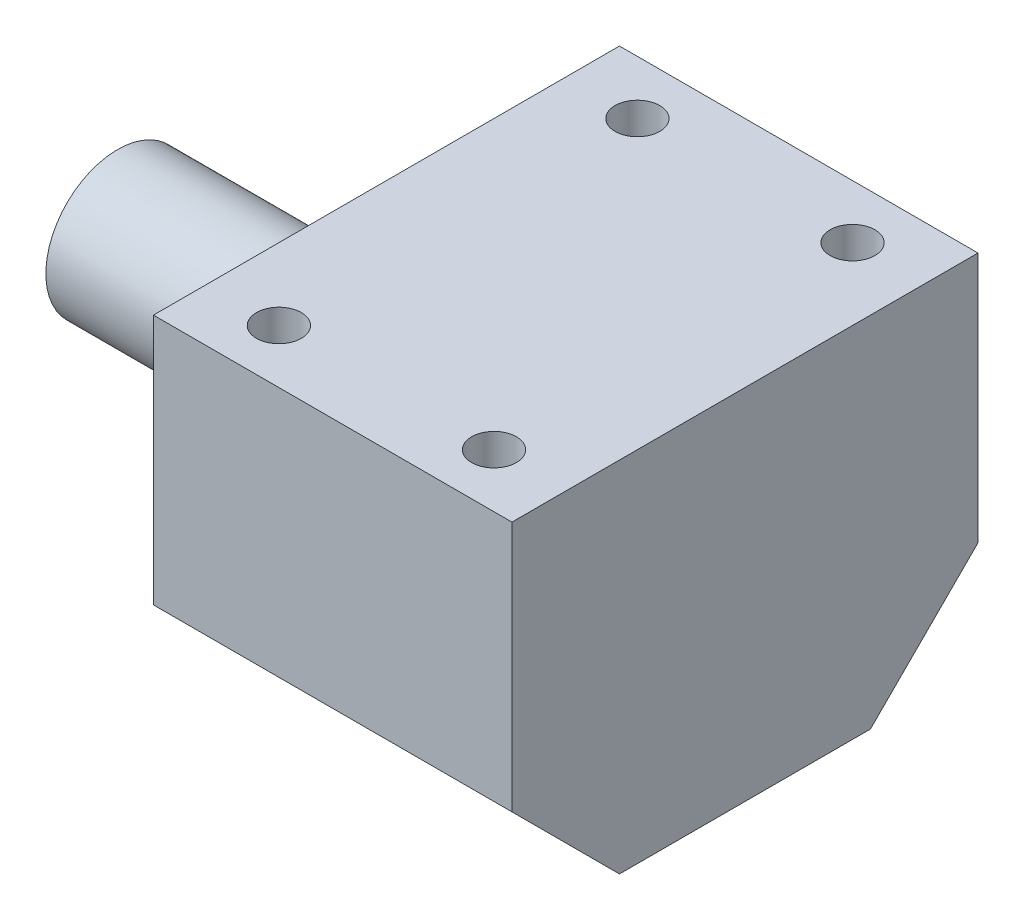
ISO-10303-21;
HEADER;
FILE_DESCRIPTION(('STEP AP214'),'2;1');
FILE_NAME('part.step','',(''),(''),'','','');
FILE_SCHEMA(('AUTOMOTIVE_DESIGN { 1 0 10303 214 1 1 1 1 }'));
ENDSEC;
DATA;
#1=APPLICATION_CONTEXT('core data for automotive mechanical design processes');
#2=APPLICATION_PROTOCOL_DEFINITION('international standard','automotive_design',2000,#1);
#3=PRODUCT_CONTEXT('',#1,'mechanical');
#4=PRODUCT('Part','Part','',(#3));
#5=PRODUCT_RELATED_PRODUCT_CATEGORY('part','',(#4));
#6=PRODUCT_DEFINITION_FORMATION('','',#4);
#7=PRODUCT_DEFINITION_CONTEXT('part definition',#1,'design');
#8=PRODUCT_DEFINITION('design','',#6,#7);
#9=PRODUCT_DEFINITION_SHAPE('','',#8);
#10=(LENGTH_UNIT() NAMED_UNIT(*) SI_UNIT(.MILLI.,.METRE.));
#11=(NAMED_UNIT(*) PLANE_ANGLE_UNIT() SI_UNIT($,.RADIAN.));
#12=(NAMED_UNIT(*) SI_UNIT($,.STERADIAN.) SOLID_ANGLE_UNIT());
#13=UNCERTAINTY_MEASURE_WITH_UNIT(LENGTH_MEASURE(1.E-05),#10,'distance_accuracy_value','');
#14=(GEOMETRIC_REPRESENTATION_CONTEXT(3) GLOBAL_UNCERTAINTY_ASSIGNED_CONTEXT((#13)) GLOBAL_UNIT_ASSIGNED_CONTEXT((#10,
#11,#12)) REPRESENTATION_CONTEXT('',''));
#15=CARTESIAN_POINT('',(0.,0.,0.));
#16=DIRECTION('',(0.,0.,1.));
#17=DIRECTION('',(1.,0.,0.));
#18=AXIS2_PLACEMENT_3D('',#15,#16,#17);
#19=CARTESIAN_POINT('',(150.,0.,0.));
#20=DIRECTION('',(-1.,0.,0.));
#21=DIRECTION('',(0.,0.,1.));
#22=AXIS2_PLACEMENT_3D('',#19,#20,#21);
#23=CYLINDRICAL_SURFACE('',#22,8.);
#24=CARTESIAN_POINT('',(0.,0.,0.));
#25=DIRECTION('',(1.,0.,0.));
#26=DIRECTION('',(0.,0.,-1.));
#27=AXIS2_PLACEMENT_3D('',#24,#25,#26);
#28=CIRCLE('',#27,8.);
#29=CARTESIAN_POINT('',(0.,0.,-8.));
#30=VERTEX_POINT('',#29);
#31=EDGE_CURVE('E114',#30,#30,#28,.T.);
#32=ORIENTED_EDGE('',*,*,#31,.T.);
#33=EDGE_LOOP('',(#32));
#34=FACE_BOUND('',#33,.T.);
#35=CARTESIAN_POINT('',(30.,0.,0.));
#36=DIRECTION('',(1.,0.,0.));
#37=DIRECTION('',(0.,0.,-1.));
#38=AXIS2_PLACEMENT_3D('',#35,#36,#37);
#39=CIRCLE('',#38,8.);
#40=CARTESIAN_POINT('',(30.,0.,-8.));
#41=VERTEX_POINT('',#40);
#42=EDGE_CURVE('E117',#41,#41,#39,.T.);
#43=ORIENTED_EDGE('',*,*,#42,.F.);
#44=EDGE_LOOP('',(#43));
#45=FACE_BOUND('',#44,.T.);
#46=ADVANCED_FACE('F33',(#34,#45),#23,.T.);
#47=CARTESIAN_POINT('',(0.,0.,0.));
#48=DIRECTION('',(1.,0.,0.));
#49=DIRECTION('',(0.,0.,-1.));
#50=AXIS2_PLACEMENT_3D('',#47,#48,#49);
#51=PLANE('',#50);
#52=ORIENTED_EDGE('',*,*,#31,.F.);
#53=EDGE_LOOP('',(#52));
#54=FACE_BOUND('',#53,.T.);
#55=ADVANCED_FACE('F209',(#54),#51,.F.);
#56=CARTESIAN_POINT('',(30.,20.,26.));
#57=DIRECTION('',(1.,0.,0.));
#58=DIRECTION('',(0.,0.,-1.));
#59=AXIS2_PLACEMENT_3D('',#56,#57,#58);
#60=PLANE('',#59);
#61=DIRECTION('',(0.,0.,1.));
#62=VECTOR('',#61,1.);
#63=CARTESIAN_POINT('',(30.,-20.,26.));
#64=LINE('',#63,#62);
#65=CARTESIAN_POINT('',(30.,-20.,-13.9999999999999));
#66=VERTEX_POINT('',#65);
#67=CARTESIAN_POINT('',(30.,-20.,14.));
#68=VERTEX_POINT('',#67);
#69=EDGE_CURVE('E134',#66,#68,#64,.T.);
#70=ORIENTED_EDGE('',*,*,#69,.T.);
#71=DIRECTION('',(0.,-0.707106781186546,-0.707106781186549));
#72=VECTOR('',#71,1.);
#73=CARTESIAN_POINT('',(30.,-8.00000000000001,26.));
#74=LINE('',#73,#72);
#75=CARTESIAN_POINT('',(30.,-8.,26.));
#76=VERTEX_POINT('',#75);
#77=EDGE_CURVE('E41',#68,#76,#74,.F.);
#78=ORIENTED_EDGE('',*,*,#77,.T.);
#79=DIRECTION('',(0.,-1.,0.));
#80=VECTOR('',#79,1.);
#81=CARTESIAN_POINT('',(30.,20.,26.));
#82=LINE('',#81,#80);
#83=CARTESIAN_POINT('',(30.,20.,26.));
#84=VERTEX_POINT('',#83);
#85=EDGE_CURVE('E93',#84,#76,#82,.T.);
#86=ORIENTED_EDGE('',*,*,#85,.F.);
#87=DIRECTION('',(0.,0.,1.));
#88=VECTOR('',#87,1.);
#89=CARTESIAN_POINT('',(30.,20.,26.));
#90=LINE('',#89,#88);
#91=CARTESIAN_POINT('',(30.,20.,-26.));
#92=VERTEX_POINT('',#91);
#93=EDGE_CURVE('E100',#92,#84,#90,.T.);
#94=ORIENTED_EDGE('',*,*,#93,.F.);
#95=DIRECTION('',(0.,-1.,0.));
#96=VECTOR('',#95,1.);
#97=CARTESIAN_POINT('',(30.,20.,-26.));
#98=LINE('',#97,#96);
#99=CARTESIAN_POINT('',(30.,-7.99999999999997,-26.));
#100=VERTEX_POINT('',#99);
#101=EDGE_CURVE('E135',#92,#100,#98,.T.);
#102=ORIENTED_EDGE('',*,*,#101,.T.);
#103=DIRECTION('',(0.,0.707106781186546,-0.707106781186549));
#104=VECTOR('',#103,1.);
#105=CARTESIAN_POINT('',(30.,-7.99999999999997,-26.));
#106=LINE('',#105,#104);
#107=EDGE_CURVE('E48',#100,#66,#106,.F.);
#108=ORIENTED_EDGE('',*,*,#107,.T.);
#109=EDGE_LOOP('',(#70,#78,#86,#94,#102,#108));
#110=FACE_BOUND('',#109,.T.);
#111=ORIENTED_EDGE('',*,*,#42,.T.);
#112=EDGE_LOOP('',(#111));
#113=FACE_BOUND('',#112,.T.);
#114=ADVANCED_FACE('F111',(#110,#113),#60,.F.);
#115=CARTESIAN_POINT('',(70.,20.,26.));
#116=DIRECTION('',(-1.,0.,0.));
#117=DIRECTION('',(0.,0.,1.));
#118=AXIS2_PLACEMENT_3D('',#115,#116,#117);
#119=PLANE('',#118);
#120=DIRECTION('',(0.,-1.,0.));
#121=VECTOR('',#120,1.);
#122=CARTESIAN_POINT('',(70.,20.,26.));
#123=LINE('',#122,#121);
#124=CARTESIAN_POINT('',(70.,20.,26.));
#125=VERTEX_POINT('',#124);
#126=CARTESIAN_POINT('',(70.,-8.,26.));
#127=VERTEX_POINT('',#126);
#128=EDGE_CURVE('E96',#125,#127,#123,.T.);
#129=ORIENTED_EDGE('',*,*,#128,.T.);
#130=DIRECTION('',(0.,0.707106781186546,0.707106781186549));
#131=VECTOR('',#130,1.);
#132=CARTESIAN_POINT('',(70.,-8.,26.));
#133=LINE('',#132,#131);
#134=CARTESIAN_POINT('',(70.,-20.,14.));
#135=VERTEX_POINT('',#134);
#136=EDGE_CURVE('E129',#127,#135,#133,.F.);
#137=ORIENTED_EDGE('',*,*,#136,.T.);
#138=DIRECTION('',(0.,0.,-1.));
#139=VECTOR('',#138,1.);
#140=CARTESIAN_POINT('',(70.,-20.,26.));
#141=LINE('',#140,#139);
#142=CARTESIAN_POINT('',(70.,-20.,-13.9999999999999));
#143=VERTEX_POINT('',#142);
#144=EDGE_CURVE('E109',#135,#143,#141,.T.);
#145=ORIENTED_EDGE('',*,*,#144,.T.);
#146=DIRECTION('',(0.,-0.707106781186546,0.707106781186549));
#147=VECTOR('',#146,1.);
#148=CARTESIAN_POINT('',(70.,-7.99999999999998,-26.));
#149=LINE('',#148,#147);
#150=CARTESIAN_POINT('',(70.,-7.99999999999997,-26.));
#151=VERTEX_POINT('',#150);
#152=EDGE_CURVE('E127',#143,#151,#149,.F.);
#153=ORIENTED_EDGE('',*,*,#152,.T.);
#154=DIRECTION('',(0.,-1.,0.));
#155=VECTOR('',#154,1.);
#156=CARTESIAN_POINT('',(70.,20.,-26.));
#157=LINE('',#156,#155);
#158=CARTESIAN_POINT('',(70.,20.,-26.));
#159=VERTEX_POINT('',#158);
#160=EDGE_CURVE('E119',#159,#151,#157,.T.);
#161=ORIENTED_EDGE('',*,*,#160,.F.);
#162=DIRECTION('',(0.,0.,-1.));
#163=VECTOR('',#162,1.);
#164=CARTESIAN_POINT('',(70.,20.,26.));
#165=LINE('',#164,#163);
#166=EDGE_CURVE('E99',#125,#159,#165,.T.);
#167=ORIENTED_EDGE('',*,*,#166,.F.);
#168=EDGE_LOOP('',(#129,#137,#145,#153,#161,#167));
#169=FACE_BOUND('',#168,.T.);
#170=ADVANCED_FACE('F144',(#169),#119,.F.);
#171=CARTESIAN_POINT('',(70.,20.,26.));
#172=DIRECTION('',(0.,0.,-1.));
#173=DIRECTION('',(-1.,0.,0.));
#174=AXIS2_PLACEMENT_3D('',#171,#172,#173);
#175=PLANE('',#174);
#176=ORIENTED_EDGE('',*,*,#85,.T.);
#177=DIRECTION('',(1.,0.,0.));
#178=VECTOR('',#177,1.);
#179=CARTESIAN_POINT('',(70.,-8.,26.));
#180=LINE('',#179,#178);
#181=EDGE_CURVE('E125',#76,#127,#180,.T.);
#182=ORIENTED_EDGE('',*,*,#181,.T.);
#183=ORIENTED_EDGE('',*,*,#128,.F.);
#184=DIRECTION('',(1.,0.,0.));
#185=VECTOR('',#184,1.);
#186=CARTESIAN_POINT('',(70.,20.,26.));
#187=LINE('',#186,#185);
#188=EDGE_CURVE('E88',#84,#125,#187,.T.);
#189=ORIENTED_EDGE('',*,*,#188,.F.);
#190=EDGE_LOOP('',(#176,#182,#183,#189));
#191=FACE_BOUND('',#190,.T.);
#192=ADVANCED_FACE('F90',(#191),#175,.F.);
#193=CARTESIAN_POINT('',(70.,20.,-26.));
#194=DIRECTION('',(0.,0.,1.));
#195=DIRECTION('',(1.,0.,0.));
#196=AXIS2_PLACEMENT_3D('',#193,#194,#195);
#197=PLANE('',#196);
#198=ORIENTED_EDGE('',*,*,#160,.T.);
#199=DIRECTION('',(-1.,0.,0.));
#200=VECTOR('',#199,1.);
#201=CARTESIAN_POINT('',(70.,-7.99999999999998,-26.));
#202=LINE('',#201,#200);
#203=EDGE_CURVE('E11',#151,#100,#202,.T.);
#204=ORIENTED_EDGE('',*,*,#203,.T.);
#205=ORIENTED_EDGE('',*,*,#101,.F.);
#206=DIRECTION('',(-1.,0.,0.));
#207=VECTOR('',#206,1.);
#208=CARTESIAN_POINT('',(70.,20.,-26.));
#209=LINE('',#208,#207);
#210=EDGE_CURVE('E105',#159,#92,#209,.T.);
#211=ORIENTED_EDGE('',*,*,#210,.F.);
#212=EDGE_LOOP('',(#198,#204,#205,#211));
#213=FACE_BOUND('',#212,.T.);
#214=ADVANCED_FACE('F146',(#213),#197,.F.);
#215=CARTESIAN_POINT('',(0.,20.,0.));
#216=DIRECTION('',(0.,1.,0.));
#217=DIRECTION('',(0.,0.,1.));
#218=AXIS2_PLACEMENT_3D('',#215,#216,#217);
#219=PLANE('',#218);
#220=CARTESIAN_POINT('',(62.,20.,20.));
#221=DIRECTION('',(0.,1.,0.));
#222=DIRECTION('',(0.,0.,1.));
#223=AXIS2_PLACEMENT_3D('',#220,#221,#222);
#224=CIRCLE('',#223,2.50000000000002);
#225=CARTESIAN_POINT('',(62.,20.,22.5));
#226=VERTEX_POINT('',#225);
#227=EDGE_CURVE('E170',#226,#226,#224,.T.);
#228=ORIENTED_EDGE('',*,*,#227,.F.);
#229=EDGE_LOOP('',(#228));
#230=FACE_BOUND('',#229,.T.);
#231=CARTESIAN_POINT('',(38.,20.,20.));
#232=DIRECTION('',(0.,1.,0.));
#233=DIRECTION('',(0.,0.,1.));
#234=AXIS2_PLACEMENT_3D('',#231,#232,#233);
#235=CIRCLE('',#234,2.49999999999999);
#236=CARTESIAN_POINT('',(38.,20.,22.5));
#237=VERTEX_POINT('',#236);
#238=EDGE_CURVE('E164',#237,#237,#235,.T.);
#239=ORIENTED_EDGE('',*,*,#238,.F.);
#240=EDGE_LOOP('',(#239));
#241=FACE_BOUND('',#240,.T.);
#242=CARTESIAN_POINT('',(62.,20.,-20.));
#243=DIRECTION('',(0.,1.,0.));
#244=DIRECTION('',(0.,0.,1.));
#245=AXIS2_PLACEMENT_3D('',#242,#243,#244);
#246=CIRCLE('',#245,2.50000000000002);
#247=CARTESIAN_POINT('',(62.,20.,-17.5));
#248=VERTEX_POINT('',#247);
#249=EDGE_CURVE('E158',#248,#248,#246,.T.);
#250=ORIENTED_EDGE('',*,*,#249,.F.);
#251=EDGE_LOOP('',(#250));
#252=FACE_BOUND('',#251,.T.);
#253=CARTESIAN_POINT('',(38.,20.,-20.));
#254=DIRECTION('',(0.,1.,0.));
#255=DIRECTION('',(0.,0.,1.));
#256=AXIS2_PLACEMENT_3D('',#253,#254,#255);
#257=CIRCLE('',#256,2.49999999999999);
#258=CARTESIAN_POINT('',(38.,20.,-17.5));
#259=VERTEX_POINT('',#258);
#260=EDGE_CURVE('E152',#259,#259,#257,.T.);
#261=ORIENTED_EDGE('',*,*,#260,.F.);
#262=EDGE_LOOP('',(#261));
#263=FACE_BOUND('',#262,.T.);
#264=ORIENTED_EDGE('',*,*,#93,.T.);
#265=ORIENTED_EDGE('',*,*,#188,.T.);
#266=ORIENTED_EDGE('',*,*,#166,.T.);
#267=ORIENTED_EDGE('',*,*,#210,.T.);
#268=EDGE_LOOP('',(#264,#265,#266,#267));
#269=FACE_BOUND('',#268,.T.);
#270=ADVANCED_FACE('F103',(#230,#241,#252,#263,#269),#219,.T.);
#271=CARTESIAN_POINT('',(0.,-20.,0.));
#272=DIRECTION('',(0.,1.,0.));
#273=DIRECTION('',(0.,0.,1.));
#274=AXIS2_PLACEMENT_3D('',#271,#272,#273);
#275=PLANE('',#274);
#276=ORIENTED_EDGE('',*,*,#144,.F.);
#277=DIRECTION('',(-1.,0.,0.));
#278=VECTOR('',#277,1.);
#279=CARTESIAN_POINT('',(0.,-20.,14.));
#280=LINE('',#279,#278);
#281=EDGE_CURVE('E55',#135,#68,#280,.T.);
#282=ORIENTED_EDGE('',*,*,#281,.T.);
#283=ORIENTED_EDGE('',*,*,#69,.F.);
#284=DIRECTION('',(1.,0.,0.));
#285=VECTOR('',#284,1.);
#286=CARTESIAN_POINT('',(0.,-20.,-13.9999999999999));
#287=LINE('',#286,#285);
#288=EDGE_CURVE('E131',#66,#143,#287,.T.);
#289=ORIENTED_EDGE('',*,*,#288,.T.);
#290=EDGE_LOOP('',(#276,#282,#283,#289));
#291=FACE_BOUND('',#290,.T.);
#292=ADVANCED_FACE('F136',(#291),#275,.F.);
#293=CARTESIAN_POINT('',(70.,-8.,26.));
#294=DIRECTION('',(0.,0.707106781186549,-0.707106781186546));
#295=DIRECTION('',(1.,0.,0.));
#296=AXIS2_PLACEMENT_3D('',#293,#294,#295);
#297=PLANE('',#296);
#298=ORIENTED_EDGE('',*,*,#77,.F.);
#299=ORIENTED_EDGE('',*,*,#281,.F.);
#300=ORIENTED_EDGE('',*,*,#136,.F.);
#301=ORIENTED_EDGE('',*,*,#181,.F.);
#302=EDGE_LOOP('',(#298,#299,#300,#301));
#303=FACE_BOUND('',#302,.T.);
#304=ADVANCED_FACE('F206',(#303),#297,.F.);
#305=CARTESIAN_POINT('',(70.,-7.99999999999998,-26.));
#306=DIRECTION('',(0.,0.707106781186549,0.707106781186546));
#307=DIRECTION('',(-1.,0.,0.));
#308=AXIS2_PLACEMENT_3D('',#305,#306,#307);
#309=PLANE('',#308);
#310=ORIENTED_EDGE('',*,*,#152,.F.);
#311=ORIENTED_EDGE('',*,*,#288,.F.);
#312=ORIENTED_EDGE('',*,*,#107,.F.);
#313=ORIENTED_EDGE('',*,*,#203,.F.);
#314=EDGE_LOOP('',(#310,#311,#312,#313));
#315=FACE_BOUND('',#314,.T.);
#316=ADVANCED_FACE('F35',(#315),#309,.F.);
#317=CARTESIAN_POINT('',(38.,10.,-20.));
#318=DIRECTION('',(0.,1.,0.));
#319=DIRECTION('',(0.,0.,1.));
#320=AXIS2_PLACEMENT_3D('',#317,#318,#319);
#321=CYLINDRICAL_SURFACE('',#320,2.49999999999999);
#322=CARTESIAN_POINT('',(38.,10.,-20.));
#323=DIRECTION('',(0.,1.,0.));
#324=DIRECTION('',(0.,0.,1.));
#325=AXIS2_PLACEMENT_3D('',#322,#323,#324);
#326=CIRCLE('',#325,2.49999999999999);
#327=CARTESIAN_POINT('',(38.,10.,-17.5));
#328=VERTEX_POINT('',#327);
#329=EDGE_CURVE('E138',#328,#328,#326,.T.);
#330=ORIENTED_EDGE('',*,*,#329,.F.);
#331=EDGE_LOOP('',(#330));
#332=FACE_BOUND('',#331,.T.);
#333=ORIENTED_EDGE('',*,*,#260,.T.);
#334=EDGE_LOOP('',(#333));
#335=FACE_BOUND('',#334,.T.);
#336=ADVANCED_FACE('F194',(#332,#335),#321,.F.);
#337=CARTESIAN_POINT('',(38.,10.,-20.));
#338=DIRECTION('',(0.,1.,0.));
#339=DIRECTION('',(0.,0.,1.));
#340=AXIS2_PLACEMENT_3D('',#337,#338,#339);
#341=PLANE('',#340);
#342=ORIENTED_EDGE('',*,*,#329,.T.);
#343=EDGE_LOOP('',(#342));
#344=FACE_BOUND('',#343,.T.);
#345=ADVANCED_FACE('F196',(#344),#341,.T.);
#346=CARTESIAN_POINT('',(62.,10.,-20.));
#347=DIRECTION('',(0.,1.,0.));
#348=DIRECTION('',(0.,0.,1.));
#349=AXIS2_PLACEMENT_3D('',#346,#347,#348);
#350=CYLINDRICAL_SURFACE('',#349,2.50000000000002);
#351=CARTESIAN_POINT('',(62.,10.,-20.));
#352=DIRECTION('',(0.,1.,0.));
#353=DIRECTION('',(0.,0.,1.));
#354=AXIS2_PLACEMENT_3D('',#351,#352,#353);
#355=CIRCLE('',#354,2.50000000000002);
#356=CARTESIAN_POINT('',(62.,10.,-17.5));
#357=VERTEX_POINT('',#356);
#358=EDGE_CURVE('E155',#357,#357,#355,.T.);
#359=ORIENTED_EDGE('',*,*,#358,.F.);
#360=EDGE_LOOP('',(#359));
#361=FACE_BOUND('',#360,.T.);
#362=ORIENTED_EDGE('',*,*,#249,.T.);
#363=EDGE_LOOP('',(#362));
#364=FACE_BOUND('',#363,.T.);
#365=ADVANCED_FACE('F203',(#361,#364),#350,.F.);
#366=CARTESIAN_POINT('',(62.,10.,-20.));
#367=DIRECTION('',(0.,1.,0.));
#368=DIRECTION('',(0.,0.,1.));
#369=AXIS2_PLACEMENT_3D('',#366,#367,#368);
#370=PLANE('',#369);
#371=ORIENTED_EDGE('',*,*,#358,.T.);
#372=EDGE_LOOP('',(#371));
#373=FACE_BOUND('',#372,.T.);
#374=ADVANCED_FACE('F278',(#373),#370,.T.);
#375=CARTESIAN_POINT('',(38.,10.,20.));
#376=DIRECTION('',(0.,1.,0.));
#377=DIRECTION('',(0.,0.,1.));
#378=AXIS2_PLACEMENT_3D('',#375,#376,#377);
#379=CYLINDRICAL_SURFACE('',#378,2.49999999999999);
#380=CARTESIAN_POINT('',(38.,10.,20.));
#381=DIRECTION('',(0.,1.,0.));
#382=DIRECTION('',(0.,0.,1.));
#383=AXIS2_PLACEMENT_3D('',#380,#381,#382);
#384=CIRCLE('',#383,2.49999999999999);
#385=CARTESIAN_POINT('',(38.,10.,22.5));
#386=VERTEX_POINT('',#385);
#387=EDGE_CURVE('E161',#386,#386,#384,.T.);
#388=ORIENTED_EDGE('',*,*,#387,.F.);
#389=EDGE_LOOP('',(#388));
#390=FACE_BOUND('',#389,.T.);
#391=ORIENTED_EDGE('',*,*,#238,.T.);
#392=EDGE_LOOP('',(#391));
#393=FACE_BOUND('',#392,.T.);
#394=ADVANCED_FACE('F288',(#390,#393),#379,.F.);
#395=CARTESIAN_POINT('',(38.,10.,20.));
#396=DIRECTION('',(0.,1.,0.));
#397=DIRECTION('',(0.,0.,1.));
#398=AXIS2_PLACEMENT_3D('',#395,#396,#397);
#399=PLANE('',#398);
#400=ORIENTED_EDGE('',*,*,#387,.T.);
#401=EDGE_LOOP('',(#400));
#402=FACE_BOUND('',#401,.T.);
#403=ADVANCED_FACE('F181',(#402),#399,.T.);
#404=CARTESIAN_POINT('',(62.,10.,20.));
#405=DIRECTION('',(0.,1.,0.));
#406=DIRECTION('',(0.,0.,1.));
#407=AXIS2_PLACEMENT_3D('',#404,#405,#406);
#408=CYLINDRICAL_SURFACE('',#407,2.50000000000002);
#409=CARTESIAN_POINT('',(62.,10.,20.));
#410=DIRECTION('',(0.,1.,0.));
#411=DIRECTION('',(0.,0.,1.));
#412=AXIS2_PLACEMENT_3D('',#409,#410,#411);
#413=CIRCLE('',#412,2.50000000000002);
#414=CARTESIAN_POINT('',(62.,10.,22.5));
#415=VERTEX_POINT('',#414);
#416=EDGE_CURVE('E167',#415,#415,#413,.T.);
#417=ORIENTED_EDGE('',*,*,#416,.F.);
#418=EDGE_LOOP('',(#417));
#419=FACE_BOUND('',#418,.T.);
#420=ORIENTED_EDGE('',*,*,#227,.T.);
#421=EDGE_LOOP('',(#420));
#422=FACE_BOUND('',#421,.T.);
#423=ADVANCED_FACE('F178',(#419,#422),#408,.F.);
#424=CARTESIAN_POINT('',(62.,10.,20.));
#425=DIRECTION('',(0.,1.,0.));
#426=DIRECTION('',(0.,0.,1.));
#427=AXIS2_PLACEMENT_3D('',#424,#425,#426);
#428=PLANE('',#427);
#429=ORIENTED_EDGE('',*,*,#416,.T.);
#430=EDGE_LOOP('',(#429));
#431=FACE_BOUND('',#430,.T.);
#432=ADVANCED_FACE('F176',(#431),#428,.T.);
#433=CLOSED_SHELL('',(#46,#55,#114,#170,#192,#214,#270,#292,#304,#316,#336,#345,#365,#374,#394,
#403,#423,#432));
#434=MANIFOLD_SOLID_BREP('B2',#433);
#435=ADVANCED_BREP_SHAPE_REPRESENTATION('',(#18,#434),#14);
#436=SHAPE_DEFINITION_REPRESENTATION(#9,#435);
ENDSEC;
END-ISO-10303-21;
